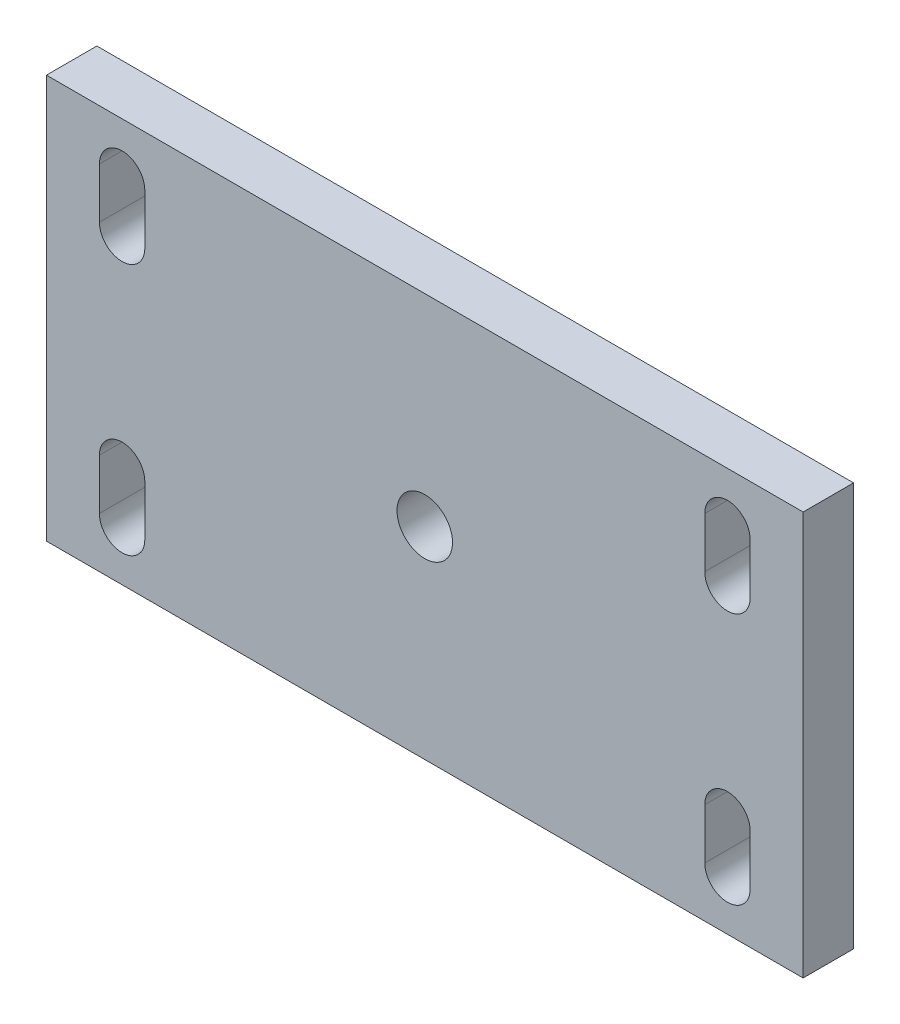
ISO-10303-21;
HEADER;
FILE_DESCRIPTION(('STEP AP214'),'2;1');
FILE_NAME('part.step','',(''),(''),'','','');
FILE_SCHEMA(('AUTOMOTIVE_DESIGN { 1 0 10303 214 1 1 1 1 }'));
ENDSEC;
DATA;
#1=APPLICATION_CONTEXT('core data for automotive mechanical design processes');
#2=APPLICATION_PROTOCOL_DEFINITION('international standard','automotive_design',2000,#1);
#3=PRODUCT_CONTEXT('',#1,'mechanical');
#4=PRODUCT('Part','Part','',(#3));
#5=PRODUCT_RELATED_PRODUCT_CATEGORY('part','',(#4));
#6=PRODUCT_DEFINITION_FORMATION('','',#4);
#7=PRODUCT_DEFINITION_CONTEXT('part definition',#1,'design');
#8=PRODUCT_DEFINITION('design','',#6,#7);
#9=PRODUCT_DEFINITION_SHAPE('','',#8);
#10=(LENGTH_UNIT() NAMED_UNIT(*) SI_UNIT(.MILLI.,.METRE.));
#11=(NAMED_UNIT(*) PLANE_ANGLE_UNIT() SI_UNIT($,.RADIAN.));
#12=(NAMED_UNIT(*) SI_UNIT($,.STERADIAN.) SOLID_ANGLE_UNIT());
#13=UNCERTAINTY_MEASURE_WITH_UNIT(LENGTH_MEASURE(1.E-05),#10,'distance_accuracy_value','');
#14=(GEOMETRIC_REPRESENTATION_CONTEXT(3) GLOBAL_UNCERTAINTY_ASSIGNED_CONTEXT((#13)) GLOBAL_UNIT_ASSIGNED_CONTEXT((#10,
#11,#12)) REPRESENTATION_CONTEXT('',''));
#15=CARTESIAN_POINT('',(0.,0.,0.));
#16=DIRECTION('',(0.,0.,1.));
#17=DIRECTION('',(1.,0.,0.));
#18=AXIS2_PLACEMENT_3D('',#15,#16,#17);
#19=CARTESIAN_POINT('',(0.,0.,10.));
#20=DIRECTION('',(0.,0.,1.));
#21=DIRECTION('',(1.,0.,0.));
#22=AXIS2_PLACEMENT_3D('',#19,#20,#21);
#23=PLANE('',#22);
#24=CARTESIAN_POINT('',(0.,0.,10.));
#25=DIRECTION('',(0.,0.,1.));
#26=DIRECTION('',(1.,0.,0.));
#27=AXIS2_PLACEMENT_3D('',#24,#25,#26);
#28=CIRCLE('',#27,5.49999999999999);
#29=CARTESIAN_POINT('',(5.49999999999999,0.,10.));
#30=VERTEX_POINT('',#29);
#31=EDGE_CURVE('E202',#30,#30,#28,.T.);
#32=ORIENTED_EDGE('',*,*,#31,.F.);
#33=EDGE_LOOP('',(#32));
#34=FACE_BOUND('',#33,.T.);
#35=DIRECTION('',(0.,1.,0.));
#36=VECTOR('',#35,1.);
#37=CARTESIAN_POINT('',(74.9999999999999,40.,10.));
#38=LINE('',#37,#36);
#39=CARTESIAN_POINT('',(75.,-40.,10.));
#40=VERTEX_POINT('',#39);
#41=CARTESIAN_POINT('',(74.9999999999999,40.,10.));
#42=VERTEX_POINT('',#41);
#43=EDGE_CURVE('E305',#40,#42,#38,.T.);
#44=ORIENTED_EDGE('',*,*,#43,.T.);
#45=DIRECTION('',(-1.,0.,0.));
#46=VECTOR('',#45,1.);
#47=CARTESIAN_POINT('',(-75.0000000000001,40.,10.));
#48=LINE('',#47,#46);
#49=CARTESIAN_POINT('',(-75.0000000000001,40.,10.));
#50=VERTEX_POINT('',#49);
#51=EDGE_CURVE('E308',#42,#50,#48,.T.);
#52=ORIENTED_EDGE('',*,*,#51,.T.);
#53=DIRECTION('',(0.,-1.,0.));
#54=VECTOR('',#53,1.);
#55=CARTESIAN_POINT('',(-75.0000000000001,40.,10.));
#56=LINE('',#55,#54);
#57=CARTESIAN_POINT('',(-75.,-40.,10.));
#58=VERTEX_POINT('',#57);
#59=EDGE_CURVE('E311',#50,#58,#56,.T.);
#60=ORIENTED_EDGE('',*,*,#59,.T.);
#61=DIRECTION('',(1.,0.,0.));
#62=VECTOR('',#61,1.);
#63=CARTESIAN_POINT('',(-75.,-40.,10.));
#64=LINE('',#63,#62);
#65=EDGE_CURVE('E313',#58,#40,#64,.T.);
#66=ORIENTED_EDGE('',*,*,#65,.T.);
#67=EDGE_LOOP('',(#44,#52,#60,#66));
#68=FACE_BOUND('',#67,.T.);
#69=DIRECTION('',(0.,-1.,0.));
#70=VECTOR('',#69,1.);
#71=CARTESIAN_POINT('',(-64.5,-20.,10.));
#72=LINE('',#71,#70);
#73=CARTESIAN_POINT('',(-64.5,-20.,10.));
#74=VERTEX_POINT('',#73);
#75=CARTESIAN_POINT('',(-64.5,-30.,10.));
#76=VERTEX_POINT('',#75);
#77=EDGE_CURVE('E276',#74,#76,#72,.T.);
#78=ORIENTED_EDGE('',*,*,#77,.F.);
#79=CARTESIAN_POINT('',(-60.,-20.,10.));
#80=DIRECTION('',(0.,0.,1.));
#81=DIRECTION('',(1.,0.,0.));
#82=AXIS2_PLACEMENT_3D('',#79,#80,#81);
#83=CIRCLE('',#82,4.5);
#84=CARTESIAN_POINT('',(-55.5,-20.,10.));
#85=VERTEX_POINT('',#84);
#86=EDGE_CURVE('E274',#85,#74,#83,.T.);
#87=ORIENTED_EDGE('',*,*,#86,.F.);
#88=DIRECTION('',(0.,1.,0.));
#89=VECTOR('',#88,1.);
#90=CARTESIAN_POINT('',(-55.5,-20.,10.));
#91=LINE('',#90,#89);
#92=CARTESIAN_POINT('',(-55.5,-30.,10.));
#93=VERTEX_POINT('',#92);
#94=EDGE_CURVE('E282',#93,#85,#91,.T.);
#95=ORIENTED_EDGE('',*,*,#94,.F.);
#96=CARTESIAN_POINT('',(-60.,-30.,10.));
#97=DIRECTION('',(0.,0.,1.));
#98=DIRECTION('',(1.,0.,0.));
#99=AXIS2_PLACEMENT_3D('',#96,#97,#98);
#100=CIRCLE('',#99,4.5);
#101=EDGE_CURVE('E279',#76,#93,#100,.T.);
#102=ORIENTED_EDGE('',*,*,#101,.F.);
#103=EDGE_LOOP('',(#78,#87,#95,#102));
#104=FACE_BOUND('',#103,.T.);
#105=DIRECTION('',(0.,1.,0.));
#106=VECTOR('',#105,1.);
#107=CARTESIAN_POINT('',(-55.5,20.,10.));
#108=LINE('',#107,#106);
#109=CARTESIAN_POINT('',(-55.5,20.,10.));
#110=VERTEX_POINT('',#109);
#111=CARTESIAN_POINT('',(-55.5,30.,10.));
#112=VERTEX_POINT('',#111);
#113=EDGE_CURVE('E245',#110,#112,#108,.T.);
#114=ORIENTED_EDGE('',*,*,#113,.F.);
#115=CARTESIAN_POINT('',(-60.,20.,10.));
#116=DIRECTION('',(0.,0.,1.));
#117=DIRECTION('',(-1.,0.,0.));
#118=AXIS2_PLACEMENT_3D('',#115,#116,#117);
#119=CIRCLE('',#118,4.5);
#120=CARTESIAN_POINT('',(-64.5,20.,10.));
#121=VERTEX_POINT('',#120);
#122=EDGE_CURVE('E243',#121,#110,#119,.T.);
#123=ORIENTED_EDGE('',*,*,#122,.F.);
#124=DIRECTION('',(0.,-1.,0.));
#125=VECTOR('',#124,1.);
#126=CARTESIAN_POINT('',(-64.5,20.,10.));
#127=LINE('',#126,#125);
#128=CARTESIAN_POINT('',(-64.5,30.,10.));
#129=VERTEX_POINT('',#128);
#130=EDGE_CURVE('E251',#129,#121,#127,.T.);
#131=ORIENTED_EDGE('',*,*,#130,.F.);
#132=CARTESIAN_POINT('',(-60.,30.,10.));
#133=DIRECTION('',(0.,0.,1.));
#134=DIRECTION('',(-1.,0.,0.));
#135=AXIS2_PLACEMENT_3D('',#132,#133,#134);
#136=CIRCLE('',#135,4.5);
#137=EDGE_CURVE('E248',#112,#129,#136,.T.);
#138=ORIENTED_EDGE('',*,*,#137,.F.);
#139=EDGE_LOOP('',(#114,#123,#131,#138));
#140=FACE_BOUND('',#139,.T.);
#141=DIRECTION('',(0.,-1.,0.));
#142=VECTOR('',#141,1.);
#143=CARTESIAN_POINT('',(55.5,-20.,10.));
#144=LINE('',#143,#142);
#145=CARTESIAN_POINT('',(55.5,-20.,10.));
#146=VERTEX_POINT('',#145);
#147=CARTESIAN_POINT('',(55.5,-30.,10.));
#148=VERTEX_POINT('',#147);
#149=EDGE_CURVE('E214',#146,#148,#144,.T.);
#150=ORIENTED_EDGE('',*,*,#149,.F.);
#151=CARTESIAN_POINT('',(60.,-20.,10.));
#152=DIRECTION('',(0.,0.,1.));
#153=DIRECTION('',(-1.,0.,0.));
#154=AXIS2_PLACEMENT_3D('',#151,#152,#153);
#155=CIRCLE('',#154,4.5);
#156=CARTESIAN_POINT('',(64.5,-20.,10.));
#157=VERTEX_POINT('',#156);
#158=EDGE_CURVE('E212',#157,#146,#155,.T.);
#159=ORIENTED_EDGE('',*,*,#158,.F.);
#160=DIRECTION('',(0.,1.,0.));
#161=VECTOR('',#160,1.);
#162=CARTESIAN_POINT('',(64.5,-20.,10.));
#163=LINE('',#162,#161);
#164=CARTESIAN_POINT('',(64.5,-30.,10.));
#165=VERTEX_POINT('',#164);
#166=EDGE_CURVE('E220',#165,#157,#163,.T.);
#167=ORIENTED_EDGE('',*,*,#166,.F.);
#168=CARTESIAN_POINT('',(60.,-30.,10.));
#169=DIRECTION('',(0.,0.,1.));
#170=DIRECTION('',(-1.,0.,0.));
#171=AXIS2_PLACEMENT_3D('',#168,#169,#170);
#172=CIRCLE('',#171,4.5);
#173=EDGE_CURVE('E217',#148,#165,#172,.T.);
#174=ORIENTED_EDGE('',*,*,#173,.F.);
#175=EDGE_LOOP('',(#150,#159,#167,#174));
#176=FACE_BOUND('',#175,.T.);
#177=DIRECTION('',(0.,1.,0.));
#178=VECTOR('',#177,1.);
#179=CARTESIAN_POINT('',(64.5,20.,10.));
#180=LINE('',#179,#178);
#181=CARTESIAN_POINT('',(64.5,20.,10.));
#182=VERTEX_POINT('',#181);
#183=CARTESIAN_POINT('',(64.5,30.,10.));
#184=VERTEX_POINT('',#183);
#185=EDGE_CURVE('E182',#182,#184,#180,.T.);
#186=ORIENTED_EDGE('',*,*,#185,.F.);
#187=CARTESIAN_POINT('',(60.,20.,10.));
#188=DIRECTION('',(0.,0.,1.));
#189=DIRECTION('',(1.,0.,0.));
#190=AXIS2_PLACEMENT_3D('',#187,#188,#189);
#191=CIRCLE('',#190,4.5);
#192=CARTESIAN_POINT('',(55.5,20.,10.));
#193=VERTEX_POINT('',#192);
#194=EDGE_CURVE('E174',#193,#182,#191,.T.);
#195=ORIENTED_EDGE('',*,*,#194,.F.);
#196=DIRECTION('',(0.,-1.,0.));
#197=VECTOR('',#196,1.);
#198=CARTESIAN_POINT('',(55.5,20.,10.));
#199=LINE('',#198,#197);
#200=CARTESIAN_POINT('',(55.5,30.,10.));
#201=VERTEX_POINT('',#200);
#202=EDGE_CURVE('E196',#201,#193,#199,.T.);
#203=ORIENTED_EDGE('',*,*,#202,.F.);
#204=CARTESIAN_POINT('',(60.,30.,10.));
#205=DIRECTION('',(0.,0.,1.));
#206=DIRECTION('',(1.,0.,0.));
#207=AXIS2_PLACEMENT_3D('',#204,#205,#206);
#208=CIRCLE('',#207,4.5);
#209=EDGE_CURVE('E194',#184,#201,#208,.T.);
#210=ORIENTED_EDGE('',*,*,#209,.F.);
#211=EDGE_LOOP('',(#186,#195,#203,#210));
#212=FACE_BOUND('',#211,.T.);
#213=ADVANCED_FACE('F37',(#34,#68,#104,#140,#176,#212),#23,.T.);
#214=CARTESIAN_POINT('',(0.,0.,0.));
#215=DIRECTION('',(0.,0.,1.));
#216=DIRECTION('',(1.,0.,0.));
#217=AXIS2_PLACEMENT_3D('',#214,#215,#216);
#218=PLANE('',#217);
#219=CARTESIAN_POINT('',(0.,0.,0.));
#220=DIRECTION('',(0.,0.,-1.));
#221=DIRECTION('',(-1.,0.,0.));
#222=AXIS2_PLACEMENT_3D('',#219,#220,#221);
#223=CIRCLE('',#222,5.5);
#224=CARTESIAN_POINT('',(-5.5,0.,0.));
#225=VERTEX_POINT('',#224);
#226=EDGE_CURVE('E552',#225,#225,#223,.T.);
#227=ORIENTED_EDGE('',*,*,#226,.F.);
#228=EDGE_LOOP('',(#227));
#229=FACE_BOUND('',#228,.T.);
#230=CARTESIAN_POINT('',(60.,-20.,0.));
#231=DIRECTION('',(0.,0.,1.));
#232=DIRECTION('',(-1.,0.,0.));
#233=AXIS2_PLACEMENT_3D('',#230,#231,#232);
#234=CIRCLE('',#233,4.5);
#235=CARTESIAN_POINT('',(64.5,-20.,0.));
#236=VERTEX_POINT('',#235);
#237=CARTESIAN_POINT('',(55.5,-20.,0.));
#238=VERTEX_POINT('',#237);
#239=EDGE_CURVE('E190',#236,#238,#234,.T.);
#240=ORIENTED_EDGE('',*,*,#239,.T.);
#241=DIRECTION('',(0.,-1.,0.));
#242=VECTOR('',#241,1.);
#243=CARTESIAN_POINT('',(55.5,-20.,0.));
#244=LINE('',#243,#242);
#245=CARTESIAN_POINT('',(55.5,-30.,0.));
#246=VERTEX_POINT('',#245);
#247=EDGE_CURVE('E225',#238,#246,#244,.T.);
#248=ORIENTED_EDGE('',*,*,#247,.T.);
#249=CARTESIAN_POINT('',(60.,-30.,0.));
#250=DIRECTION('',(0.,0.,1.));
#251=DIRECTION('',(-1.,0.,0.));
#252=AXIS2_PLACEMENT_3D('',#249,#250,#251);
#253=CIRCLE('',#252,4.5);
#254=CARTESIAN_POINT('',(64.5,-30.,0.));
#255=VERTEX_POINT('',#254);
#256=EDGE_CURVE('E228',#246,#255,#253,.T.);
#257=ORIENTED_EDGE('',*,*,#256,.T.);
#258=DIRECTION('',(0.,1.,0.));
#259=VECTOR('',#258,1.);
#260=CARTESIAN_POINT('',(64.5,-20.,0.));
#261=LINE('',#260,#259);
#262=EDGE_CURVE('E215',#255,#236,#261,.T.);
#263=ORIENTED_EDGE('',*,*,#262,.T.);
#264=EDGE_LOOP('',(#240,#248,#257,#263));
#265=FACE_BOUND('',#264,.T.);
#266=CARTESIAN_POINT('',(-60.,-20.,0.));
#267=DIRECTION('',(0.,0.,1.));
#268=DIRECTION('',(1.,0.,0.));
#269=AXIS2_PLACEMENT_3D('',#266,#267,#268);
#270=CIRCLE('',#269,4.5);
#271=CARTESIAN_POINT('',(-55.5,-20.,0.));
#272=VERTEX_POINT('',#271);
#273=CARTESIAN_POINT('',(-64.5,-20.,0.));
#274=VERTEX_POINT('',#273);
#275=EDGE_CURVE('E273',#272,#274,#270,.T.);
#276=ORIENTED_EDGE('',*,*,#275,.T.);
#277=DIRECTION('',(0.,-1.,0.));
#278=VECTOR('',#277,1.);
#279=CARTESIAN_POINT('',(-64.5,-20.,0.));
#280=LINE('',#279,#278);
#281=CARTESIAN_POINT('',(-64.5,-30.,0.));
#282=VERTEX_POINT('',#281);
#283=EDGE_CURVE('E287',#274,#282,#280,.T.);
#284=ORIENTED_EDGE('',*,*,#283,.T.);
#285=CARTESIAN_POINT('',(-60.,-30.,0.));
#286=DIRECTION('',(0.,0.,1.));
#287=DIRECTION('',(1.,0.,0.));
#288=AXIS2_PLACEMENT_3D('',#285,#286,#287);
#289=CIRCLE('',#288,4.5);
#290=CARTESIAN_POINT('',(-55.5,-30.,0.));
#291=VERTEX_POINT('',#290);
#292=EDGE_CURVE('E290',#282,#291,#289,.T.);
#293=ORIENTED_EDGE('',*,*,#292,.T.);
#294=DIRECTION('',(0.,1.,0.));
#295=VECTOR('',#294,1.);
#296=CARTESIAN_POINT('',(-55.5,-20.,0.));
#297=LINE('',#296,#295);
#298=EDGE_CURVE('E277',#291,#272,#297,.T.);
#299=ORIENTED_EDGE('',*,*,#298,.T.);
#300=EDGE_LOOP('',(#276,#284,#293,#299));
#301=FACE_BOUND('',#300,.T.);
#302=DIRECTION('',(0.,1.,0.));
#303=VECTOR('',#302,1.);
#304=CARTESIAN_POINT('',(74.9999999999999,40.,0.));
#305=LINE('',#304,#303);
#306=CARTESIAN_POINT('',(75.,-40.,0.));
#307=VERTEX_POINT('',#306);
#308=CARTESIAN_POINT('',(74.9999999999999,40.,0.));
#309=VERTEX_POINT('',#308);
#310=EDGE_CURVE('E304',#307,#309,#305,.T.);
#311=ORIENTED_EDGE('',*,*,#310,.F.);
#312=DIRECTION('',(1.,0.,0.));
#313=VECTOR('',#312,1.);
#314=CARTESIAN_POINT('',(-75.,-40.,0.));
#315=LINE('',#314,#313);
#316=CARTESIAN_POINT('',(-75.,-40.,0.));
#317=VERTEX_POINT('',#316);
#318=EDGE_CURVE('E309',#317,#307,#315,.T.);
#319=ORIENTED_EDGE('',*,*,#318,.F.);
#320=DIRECTION('',(0.,-1.,0.));
#321=VECTOR('',#320,1.);
#322=CARTESIAN_POINT('',(-75.0000000000001,40.,0.));
#323=LINE('',#322,#321);
#324=CARTESIAN_POINT('',(-75.0000000000001,40.,0.));
#325=VERTEX_POINT('',#324);
#326=EDGE_CURVE('E320',#325,#317,#323,.T.);
#327=ORIENTED_EDGE('',*,*,#326,.F.);
#328=DIRECTION('',(-1.,0.,0.));
#329=VECTOR('',#328,1.);
#330=CARTESIAN_POINT('',(-75.0000000000001,40.,0.));
#331=LINE('',#330,#329);
#332=EDGE_CURVE('E318',#309,#325,#331,.T.);
#333=ORIENTED_EDGE('',*,*,#332,.F.);
#334=EDGE_LOOP('',(#311,#319,#327,#333));
#335=FACE_BOUND('',#334,.T.);
#336=CARTESIAN_POINT('',(-60.,20.,0.));
#337=DIRECTION('',(0.,0.,1.));
#338=DIRECTION('',(-1.,0.,0.));
#339=AXIS2_PLACEMENT_3D('',#336,#337,#338);
#340=CIRCLE('',#339,4.5);
#341=CARTESIAN_POINT('',(-64.5,20.,0.));
#342=VERTEX_POINT('',#341);
#343=CARTESIAN_POINT('',(-55.5,20.,0.));
#344=VERTEX_POINT('',#343);
#345=EDGE_CURVE('E242',#342,#344,#340,.T.);
#346=ORIENTED_EDGE('',*,*,#345,.T.);
#347=DIRECTION('',(0.,1.,0.));
#348=VECTOR('',#347,1.);
#349=CARTESIAN_POINT('',(-55.5,20.,0.));
#350=LINE('',#349,#348);
#351=CARTESIAN_POINT('',(-55.5,30.,0.));
#352=VERTEX_POINT('',#351);
#353=EDGE_CURVE('E256',#344,#352,#350,.T.);
#354=ORIENTED_EDGE('',*,*,#353,.T.);
#355=CARTESIAN_POINT('',(-60.,30.,0.));
#356=DIRECTION('',(0.,0.,1.));
#357=DIRECTION('',(-1.,0.,0.));
#358=AXIS2_PLACEMENT_3D('',#355,#356,#357);
#359=CIRCLE('',#358,4.5);
#360=CARTESIAN_POINT('',(-64.5,30.,0.));
#361=VERTEX_POINT('',#360);
#362=EDGE_CURVE('E259',#352,#361,#359,.T.);
#363=ORIENTED_EDGE('',*,*,#362,.T.);
#364=DIRECTION('',(0.,-1.,0.));
#365=VECTOR('',#364,1.);
#366=CARTESIAN_POINT('',(-64.5,20.,0.));
#367=LINE('',#366,#365);
#368=EDGE_CURVE('E246',#361,#342,#367,.T.);
#369=ORIENTED_EDGE('',*,*,#368,.T.);
#370=EDGE_LOOP('',(#346,#354,#363,#369));
#371=FACE_BOUND('',#370,.T.);
#372=CARTESIAN_POINT('',(60.,20.,0.));
#373=DIRECTION('',(0.,0.,1.));
#374=DIRECTION('',(1.,0.,0.));
#375=AXIS2_PLACEMENT_3D('',#372,#373,#374);
#376=CIRCLE('',#375,4.5);
#377=CARTESIAN_POINT('',(55.5,20.,0.));
#378=VERTEX_POINT('',#377);
#379=CARTESIAN_POINT('',(64.5,20.,0.));
#380=VERTEX_POINT('',#379);
#381=EDGE_CURVE('E60',#378,#380,#376,.T.);
#382=ORIENTED_EDGE('',*,*,#381,.T.);
#383=DIRECTION('',(0.,1.,0.));
#384=VECTOR('',#383,1.);
#385=CARTESIAN_POINT('',(64.5,20.,0.));
#386=LINE('',#385,#384);
#387=CARTESIAN_POINT('',(64.5,30.,0.));
#388=VERTEX_POINT('',#387);
#389=EDGE_CURVE('E189',#380,#388,#386,.T.);
#390=ORIENTED_EDGE('',*,*,#389,.T.);
#391=CARTESIAN_POINT('',(60.,30.,0.));
#392=DIRECTION('',(0.,0.,1.));
#393=DIRECTION('',(1.,0.,0.));
#394=AXIS2_PLACEMENT_3D('',#391,#392,#393);
#395=CIRCLE('',#394,4.5);
#396=CARTESIAN_POINT('',(55.5,30.,0.));
#397=VERTEX_POINT('',#396);
#398=EDGE_CURVE('E204',#388,#397,#395,.T.);
#399=ORIENTED_EDGE('',*,*,#398,.T.);
#400=DIRECTION('',(0.,-1.,0.));
#401=VECTOR('',#400,1.);
#402=CARTESIAN_POINT('',(55.5,20.,0.));
#403=LINE('',#402,#401);
#404=EDGE_CURVE('E183',#397,#378,#403,.T.);
#405=ORIENTED_EDGE('',*,*,#404,.T.);
#406=EDGE_LOOP('',(#382,#390,#399,#405));
#407=FACE_BOUND('',#406,.T.);
#408=ADVANCED_FACE('F338',(#229,#265,#301,#335,#371,#407),#218,.F.);
#409=CARTESIAN_POINT('',(74.9999999999999,40.,10.));
#410=DIRECTION('',(-1.,0.,0.));
#411=DIRECTION('',(0.,-1.,0.));
#412=AXIS2_PLACEMENT_3D('',#409,#410,#411);
#413=PLANE('',#412);
#414=ORIENTED_EDGE('',*,*,#310,.T.);
#415=DIRECTION('',(0.,0.,-1.));
#416=VECTOR('',#415,1.);
#417=CARTESIAN_POINT('',(74.9999999999999,40.,10.));
#418=LINE('',#417,#416);
#419=EDGE_CURVE('E11',#42,#309,#418,.T.);
#420=ORIENTED_EDGE('',*,*,#419,.F.);
#421=ORIENTED_EDGE('',*,*,#43,.F.);
#422=DIRECTION('',(0.,0.,-1.));
#423=VECTOR('',#422,1.);
#424=CARTESIAN_POINT('',(75.,-40.,10.));
#425=LINE('',#424,#423);
#426=EDGE_CURVE('E315',#40,#307,#425,.T.);
#427=ORIENTED_EDGE('',*,*,#426,.T.);
#428=EDGE_LOOP('',(#414,#420,#421,#427));
#429=FACE_BOUND('',#428,.T.);
#430=ADVANCED_FACE('F39',(#429),#413,.F.);
#431=CARTESIAN_POINT('',(-75.0000000000001,40.,10.));
#432=DIRECTION('',(0.,-1.,0.));
#433=DIRECTION('',(0.,0.,-1.));
#434=AXIS2_PLACEMENT_3D('',#431,#432,#433);
#435=PLANE('',#434);
#436=ORIENTED_EDGE('',*,*,#332,.T.);
#437=DIRECTION('',(0.,0.,-1.));
#438=VECTOR('',#437,1.);
#439=CARTESIAN_POINT('',(-75.0000000000001,40.,10.));
#440=LINE('',#439,#438);
#441=EDGE_CURVE('E45',#50,#325,#440,.T.);
#442=ORIENTED_EDGE('',*,*,#441,.F.);
#443=ORIENTED_EDGE('',*,*,#51,.F.);
#444=ORIENTED_EDGE('',*,*,#419,.T.);
#445=EDGE_LOOP('',(#436,#442,#443,#444));
#446=FACE_BOUND('',#445,.T.);
#447=ADVANCED_FACE('F349',(#446),#435,.F.);
#448=CARTESIAN_POINT('',(-75.0000000000001,40.,10.));
#449=DIRECTION('',(1.,0.,0.));
#450=DIRECTION('',(0.,1.,0.));
#451=AXIS2_PLACEMENT_3D('',#448,#449,#450);
#452=PLANE('',#451);
#453=ORIENTED_EDGE('',*,*,#326,.T.);
#454=DIRECTION('',(0.,0.,-1.));
#455=VECTOR('',#454,1.);
#456=CARTESIAN_POINT('',(-75.,-40.,10.));
#457=LINE('',#456,#455);
#458=EDGE_CURVE('E325',#58,#317,#457,.T.);
#459=ORIENTED_EDGE('',*,*,#458,.F.);
#460=ORIENTED_EDGE('',*,*,#59,.F.);
#461=ORIENTED_EDGE('',*,*,#441,.T.);
#462=EDGE_LOOP('',(#453,#459,#460,#461));
#463=FACE_BOUND('',#462,.T.);
#464=ADVANCED_FACE('F332',(#463),#452,.F.);
#465=CARTESIAN_POINT('',(-75.,-40.,10.));
#466=DIRECTION('',(0.,1.,0.));
#467=DIRECTION('',(0.,0.,1.));
#468=AXIS2_PLACEMENT_3D('',#465,#466,#467);
#469=PLANE('',#468);
#470=ORIENTED_EDGE('',*,*,#318,.T.);
#471=ORIENTED_EDGE('',*,*,#426,.F.);
#472=ORIENTED_EDGE('',*,*,#65,.F.);
#473=ORIENTED_EDGE('',*,*,#458,.T.);
#474=EDGE_LOOP('',(#470,#471,#472,#473));
#475=FACE_BOUND('',#474,.T.);
#476=ADVANCED_FACE('F342',(#475),#469,.F.);
#477=CARTESIAN_POINT('',(-60.,-20.,10.));
#478=DIRECTION('',(0.,0.,-1.));
#479=DIRECTION('',(-1.,0.,0.));
#480=AXIS2_PLACEMENT_3D('',#477,#478,#479);
#481=CYLINDRICAL_SURFACE('',#480,4.5);
#482=ORIENTED_EDGE('',*,*,#275,.F.);
#483=DIRECTION('',(0.,0.,-1.));
#484=VECTOR('',#483,1.);
#485=CARTESIAN_POINT('',(-55.5,-20.,10.));
#486=LINE('',#485,#484);
#487=EDGE_CURVE('E284',#85,#272,#486,.T.);
#488=ORIENTED_EDGE('',*,*,#487,.F.);
#489=ORIENTED_EDGE('',*,*,#86,.T.);
#490=DIRECTION('',(0.,0.,-1.));
#491=VECTOR('',#490,1.);
#492=CARTESIAN_POINT('',(-64.5,-20.,10.));
#493=LINE('',#492,#491);
#494=EDGE_CURVE('E301',#74,#274,#493,.T.);
#495=ORIENTED_EDGE('',*,*,#494,.T.);
#496=EDGE_LOOP('',(#482,#488,#489,#495));
#497=FACE_BOUND('',#496,.T.);
#498=ADVANCED_FACE('F366',(#497),#481,.F.);
#499=CARTESIAN_POINT('',(-64.5,-20.,10.));
#500=DIRECTION('',(1.,0.,0.));
#501=DIRECTION('',(0.,0.,-1.));
#502=AXIS2_PLACEMENT_3D('',#499,#500,#501);
#503=PLANE('',#502);
#504=ORIENTED_EDGE('',*,*,#283,.F.);
#505=ORIENTED_EDGE('',*,*,#494,.F.);
#506=ORIENTED_EDGE('',*,*,#77,.T.);
#507=DIRECTION('',(0.,0.,-1.));
#508=VECTOR('',#507,1.);
#509=CARTESIAN_POINT('',(-64.5,-30.,10.));
#510=LINE('',#509,#508);
#511=EDGE_CURVE('E299',#76,#282,#510,.T.);
#512=ORIENTED_EDGE('',*,*,#511,.T.);
#513=EDGE_LOOP('',(#504,#505,#506,#512));
#514=FACE_BOUND('',#513,.T.);
#515=ADVANCED_FACE('F373',(#514),#503,.T.);
#516=CARTESIAN_POINT('',(-60.,-30.,10.));
#517=DIRECTION('',(0.,0.,-1.));
#518=DIRECTION('',(-1.,0.,0.));
#519=AXIS2_PLACEMENT_3D('',#516,#517,#518);
#520=CYLINDRICAL_SURFACE('',#519,4.5);
#521=ORIENTED_EDGE('',*,*,#292,.F.);
#522=ORIENTED_EDGE('',*,*,#511,.F.);
#523=ORIENTED_EDGE('',*,*,#101,.T.);
#524=DIRECTION('',(0.,0.,-1.));
#525=VECTOR('',#524,1.);
#526=CARTESIAN_POINT('',(-55.5,-30.,10.));
#527=LINE('',#526,#525);
#528=EDGE_CURVE('E297',#93,#291,#527,.T.);
#529=ORIENTED_EDGE('',*,*,#528,.T.);
#530=EDGE_LOOP('',(#521,#522,#523,#529));
#531=FACE_BOUND('',#530,.T.);
#532=ADVANCED_FACE('F378',(#531),#520,.F.);
#533=CARTESIAN_POINT('',(-55.5,-20.,10.));
#534=DIRECTION('',(-1.,0.,0.));
#535=DIRECTION('',(0.,0.,1.));
#536=AXIS2_PLACEMENT_3D('',#533,#534,#535);
#537=PLANE('',#536);
#538=ORIENTED_EDGE('',*,*,#298,.F.);
#539=ORIENTED_EDGE('',*,*,#528,.F.);
#540=ORIENTED_EDGE('',*,*,#94,.T.);
#541=ORIENTED_EDGE('',*,*,#487,.T.);
#542=EDGE_LOOP('',(#538,#539,#540,#541));
#543=FACE_BOUND('',#542,.T.);
#544=ADVANCED_FACE('F386',(#543),#537,.T.);
#545=CARTESIAN_POINT('',(-60.,20.,10.));
#546=DIRECTION('',(0.,0.,-1.));
#547=DIRECTION('',(-1.,0.,0.));
#548=AXIS2_PLACEMENT_3D('',#545,#546,#547);
#549=CYLINDRICAL_SURFACE('',#548,4.5);
#550=ORIENTED_EDGE('',*,*,#345,.F.);
#551=DIRECTION('',(0.,0.,-1.));
#552=VECTOR('',#551,1.);
#553=CARTESIAN_POINT('',(-64.5,20.,10.));
#554=LINE('',#553,#552);
#555=EDGE_CURVE('E253',#121,#342,#554,.T.);
#556=ORIENTED_EDGE('',*,*,#555,.F.);
#557=ORIENTED_EDGE('',*,*,#122,.T.);
#558=DIRECTION('',(0.,0.,-1.));
#559=VECTOR('',#558,1.);
#560=CARTESIAN_POINT('',(-55.5,20.,10.));
#561=LINE('',#560,#559);
#562=EDGE_CURVE('E270',#110,#344,#561,.T.);
#563=ORIENTED_EDGE('',*,*,#562,.T.);
#564=EDGE_LOOP('',(#550,#556,#557,#563));
#565=FACE_BOUND('',#564,.T.);
#566=ADVANCED_FACE('F441',(#565),#549,.F.);
#567=CARTESIAN_POINT('',(-55.5,20.,10.));
#568=DIRECTION('',(-1.,0.,0.));
#569=DIRECTION('',(0.,0.,1.));
#570=AXIS2_PLACEMENT_3D('',#567,#568,#569);
#571=PLANE('',#570);
#572=ORIENTED_EDGE('',*,*,#353,.F.);
#573=ORIENTED_EDGE('',*,*,#562,.F.);
#574=ORIENTED_EDGE('',*,*,#113,.T.);
#575=DIRECTION('',(0.,0.,-1.));
#576=VECTOR('',#575,1.);
#577=CARTESIAN_POINT('',(-55.5,30.,10.));
#578=LINE('',#577,#576);
#579=EDGE_CURVE('E268',#112,#352,#578,.T.);
#580=ORIENTED_EDGE('',*,*,#579,.T.);
#581=EDGE_LOOP('',(#572,#573,#574,#580));
#582=FACE_BOUND('',#581,.T.);
#583=ADVANCED_FACE('F437',(#582),#571,.T.);
#584=CARTESIAN_POINT('',(-60.,30.,10.));
#585=DIRECTION('',(0.,0.,-1.));
#586=DIRECTION('',(-1.,0.,0.));
#587=AXIS2_PLACEMENT_3D('',#584,#585,#586);
#588=CYLINDRICAL_SURFACE('',#587,4.5);
#589=ORIENTED_EDGE('',*,*,#362,.F.);
#590=ORIENTED_EDGE('',*,*,#579,.F.);
#591=ORIENTED_EDGE('',*,*,#137,.T.);
#592=DIRECTION('',(0.,0.,-1.));
#593=VECTOR('',#592,1.);
#594=CARTESIAN_POINT('',(-64.5,30.,10.));
#595=LINE('',#594,#593);
#596=EDGE_CURVE('E266',#129,#361,#595,.T.);
#597=ORIENTED_EDGE('',*,*,#596,.T.);
#598=EDGE_LOOP('',(#589,#590,#591,#597));
#599=FACE_BOUND('',#598,.T.);
#600=ADVANCED_FACE('F433',(#599),#588,.F.);
#601=CARTESIAN_POINT('',(-64.5,20.,10.));
#602=DIRECTION('',(1.,0.,0.));
#603=DIRECTION('',(0.,0.,-1.));
#604=AXIS2_PLACEMENT_3D('',#601,#602,#603);
#605=PLANE('',#604);
#606=ORIENTED_EDGE('',*,*,#368,.F.);
#607=ORIENTED_EDGE('',*,*,#596,.F.);
#608=ORIENTED_EDGE('',*,*,#130,.T.);
#609=ORIENTED_EDGE('',*,*,#555,.T.);
#610=EDGE_LOOP('',(#606,#607,#608,#609));
#611=FACE_BOUND('',#610,.T.);
#612=ADVANCED_FACE('F430',(#611),#605,.T.);
#613=CARTESIAN_POINT('',(60.,-20.,10.));
#614=DIRECTION('',(0.,0.,-1.));
#615=DIRECTION('',(-1.,0.,0.));
#616=AXIS2_PLACEMENT_3D('',#613,#614,#615);
#617=CYLINDRICAL_SURFACE('',#616,4.5);
#618=ORIENTED_EDGE('',*,*,#239,.F.);
#619=DIRECTION('',(0.,0.,-1.));
#620=VECTOR('',#619,1.);
#621=CARTESIAN_POINT('',(64.5,-20.,10.));
#622=LINE('',#621,#620);
#623=EDGE_CURVE('E222',#157,#236,#622,.T.);
#624=ORIENTED_EDGE('',*,*,#623,.F.);
#625=ORIENTED_EDGE('',*,*,#158,.T.);
#626=DIRECTION('',(0.,0.,-1.));
#627=VECTOR('',#626,1.);
#628=CARTESIAN_POINT('',(55.5,-20.,10.));
#629=LINE('',#628,#627);
#630=EDGE_CURVE('E239',#146,#238,#629,.T.);
#631=ORIENTED_EDGE('',*,*,#630,.T.);
#632=EDGE_LOOP('',(#618,#624,#625,#631));
#633=FACE_BOUND('',#632,.T.);
#634=ADVANCED_FACE('F412',(#633),#617,.F.);
#635=CARTESIAN_POINT('',(55.5,-20.,10.));
#636=DIRECTION('',(1.,0.,0.));
#637=DIRECTION('',(0.,0.,-1.));
#638=AXIS2_PLACEMENT_3D('',#635,#636,#637);
#639=PLANE('',#638);
#640=ORIENTED_EDGE('',*,*,#247,.F.);
#641=ORIENTED_EDGE('',*,*,#630,.F.);
#642=ORIENTED_EDGE('',*,*,#149,.T.);
#643=DIRECTION('',(0.,0.,-1.));
#644=VECTOR('',#643,1.);
#645=CARTESIAN_POINT('',(55.5,-30.,10.));
#646=LINE('',#645,#644);
#647=EDGE_CURVE('E237',#148,#246,#646,.T.);
#648=ORIENTED_EDGE('',*,*,#647,.T.);
#649=EDGE_LOOP('',(#640,#641,#642,#648));
#650=FACE_BOUND('',#649,.T.);
#651=ADVANCED_FACE('F405',(#650),#639,.T.);
#652=CARTESIAN_POINT('',(60.,-30.,10.));
#653=DIRECTION('',(0.,0.,-1.));
#654=DIRECTION('',(-1.,0.,0.));
#655=AXIS2_PLACEMENT_3D('',#652,#653,#654);
#656=CYLINDRICAL_SURFACE('',#655,4.5);
#657=ORIENTED_EDGE('',*,*,#256,.F.);
#658=ORIENTED_EDGE('',*,*,#647,.F.);
#659=ORIENTED_EDGE('',*,*,#173,.T.);
#660=DIRECTION('',(0.,0.,-1.));
#661=VECTOR('',#660,1.);
#662=CARTESIAN_POINT('',(64.5,-30.,10.));
#663=LINE('',#662,#661);
#664=EDGE_CURVE('E235',#165,#255,#663,.T.);
#665=ORIENTED_EDGE('',*,*,#664,.T.);
#666=EDGE_LOOP('',(#657,#658,#659,#665));
#667=FACE_BOUND('',#666,.T.);
#668=ADVANCED_FACE('F408',(#667),#656,.F.);
#669=CARTESIAN_POINT('',(64.5,-20.,10.));
#670=DIRECTION('',(-1.,0.,0.));
#671=DIRECTION('',(0.,0.,1.));
#672=AXIS2_PLACEMENT_3D('',#669,#670,#671);
#673=PLANE('',#672);
#674=ORIENTED_EDGE('',*,*,#262,.F.);
#675=ORIENTED_EDGE('',*,*,#664,.F.);
#676=ORIENTED_EDGE('',*,*,#166,.T.);
#677=ORIENTED_EDGE('',*,*,#623,.T.);
#678=EDGE_LOOP('',(#674,#675,#676,#677));
#679=FACE_BOUND('',#678,.T.);
#680=ADVANCED_FACE('F415',(#679),#673,.T.);
#681=CARTESIAN_POINT('',(60.,20.,10.));
#682=DIRECTION('',(0.,0.,-1.));
#683=DIRECTION('',(-1.,0.,0.));
#684=AXIS2_PLACEMENT_3D('',#681,#682,#683);
#685=CYLINDRICAL_SURFACE('',#684,4.5);
#686=ORIENTED_EDGE('',*,*,#381,.F.);
#687=DIRECTION('',(0.,0.,-1.));
#688=VECTOR('',#687,1.);
#689=CARTESIAN_POINT('',(55.5,20.,10.));
#690=LINE('',#689,#688);
#691=EDGE_CURVE('E178',#193,#378,#690,.T.);
#692=ORIENTED_EDGE('',*,*,#691,.F.);
#693=ORIENTED_EDGE('',*,*,#194,.T.);
#694=DIRECTION('',(0.,0.,-1.));
#695=VECTOR('',#694,1.);
#696=CARTESIAN_POINT('',(64.5,20.,10.));
#697=LINE('',#696,#695);
#698=EDGE_CURVE('E177',#182,#380,#697,.T.);
#699=ORIENTED_EDGE('',*,*,#698,.T.);
#700=EDGE_LOOP('',(#686,#692,#693,#699));
#701=FACE_BOUND('',#700,.T.);
#702=ADVANCED_FACE('F176',(#701),#685,.F.);
#703=CARTESIAN_POINT('',(64.5,20.,10.));
#704=DIRECTION('',(-1.,0.,0.));
#705=DIRECTION('',(0.,0.,1.));
#706=AXIS2_PLACEMENT_3D('',#703,#704,#705);
#707=PLANE('',#706);
#708=ORIENTED_EDGE('',*,*,#389,.F.);
#709=ORIENTED_EDGE('',*,*,#698,.F.);
#710=ORIENTED_EDGE('',*,*,#185,.T.);
#711=DIRECTION('',(0.,0.,-1.));
#712=VECTOR('',#711,1.);
#713=CARTESIAN_POINT('',(64.5,30.,10.));
#714=LINE('',#713,#712);
#715=EDGE_CURVE('E191',#184,#388,#714,.T.);
#716=ORIENTED_EDGE('',*,*,#715,.T.);
#717=EDGE_LOOP('',(#708,#709,#710,#716));
#718=FACE_BOUND('',#717,.T.);
#719=ADVANCED_FACE('F186',(#718),#707,.T.);
#720=CARTESIAN_POINT('',(60.,30.,10.));
#721=DIRECTION('',(0.,0.,-1.));
#722=DIRECTION('',(-1.,0.,0.));
#723=AXIS2_PLACEMENT_3D('',#720,#721,#722);
#724=CYLINDRICAL_SURFACE('',#723,4.5);
#725=ORIENTED_EDGE('',*,*,#398,.F.);
#726=ORIENTED_EDGE('',*,*,#715,.F.);
#727=ORIENTED_EDGE('',*,*,#209,.T.);
#728=DIRECTION('',(0.,0.,-1.));
#729=VECTOR('',#728,1.);
#730=CARTESIAN_POINT('',(55.5,30.,10.));
#731=LINE('',#730,#729);
#732=EDGE_CURVE('E52',#201,#397,#731,.T.);
#733=ORIENTED_EDGE('',*,*,#732,.T.);
#734=EDGE_LOOP('',(#725,#726,#727,#733));
#735=FACE_BOUND('',#734,.T.);
#736=ADVANCED_FACE('F504',(#735),#724,.F.);
#737=CARTESIAN_POINT('',(55.5,20.,10.));
#738=DIRECTION('',(1.,0.,0.));
#739=DIRECTION('',(0.,0.,-1.));
#740=AXIS2_PLACEMENT_3D('',#737,#738,#739);
#741=PLANE('',#740);
#742=ORIENTED_EDGE('',*,*,#404,.F.);
#743=ORIENTED_EDGE('',*,*,#732,.F.);
#744=ORIENTED_EDGE('',*,*,#202,.T.);
#745=ORIENTED_EDGE('',*,*,#691,.T.);
#746=EDGE_LOOP('',(#742,#743,#744,#745));
#747=FACE_BOUND('',#746,.T.);
#748=ADVANCED_FACE('F512',(#747),#741,.T.);
#749=CARTESIAN_POINT('',(0.,0.,0.));
#750=DIRECTION('',(0.,0.,-1.));
#751=DIRECTION('',(-1.,0.,0.));
#752=AXIS2_PLACEMENT_3D('',#749,#750,#751);
#753=CYLINDRICAL_SURFACE('',#752,5.49999999999999);
#754=ORIENTED_EDGE('',*,*,#31,.T.);
#755=EDGE_LOOP('',(#754));
#756=FACE_BOUND('',#755,.T.);
#757=ORIENTED_EDGE('',*,*,#226,.T.);
#758=EDGE_LOOP('',(#757));
#759=FACE_BOUND('',#758,.T.);
#760=ADVANCED_FACE('F521',(#756,#759),#753,.F.);
#761=CLOSED_SHELL('',(#213,#408,#430,#447,#464,#476,#498,#515,#532,#544,#566,#583,#600,#612,
#634,#651,#668,#680,#702,#719,#736,#748,#760));
#762=MANIFOLD_SOLID_BREP('B2',#761);
#763=ADVANCED_BREP_SHAPE_REPRESENTATION('',(#18,#762),#14);
#764=SHAPE_DEFINITION_REPRESENTATION(#9,#763);
ENDSEC;
END-ISO-10303-21;
